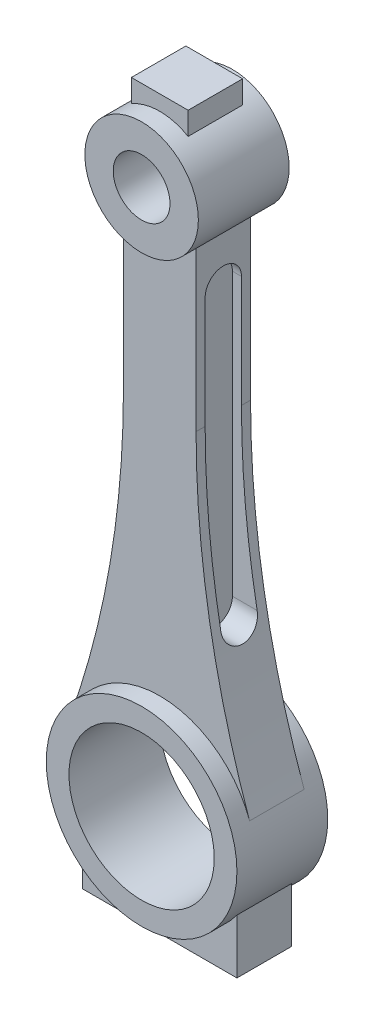
ISO-10303-21;
HEADER;
FILE_DESCRIPTION(('STEP AP214'),'2;1');
FILE_NAME('part.step','',(''),(''),'','','');
FILE_SCHEMA(('AUTOMOTIVE_DESIGN { 1 0 10303 214 1 1 1 1 }'));
ENDSEC;
DATA;
#1=APPLICATION_CONTEXT('core data for automotive mechanical design processes');
#2=APPLICATION_PROTOCOL_DEFINITION('international standard','automotive_design',2000,#1);
#3=PRODUCT_CONTEXT('',#1,'mechanical');
#4=PRODUCT('Part','Part','',(#3));
#5=PRODUCT_RELATED_PRODUCT_CATEGORY('part','',(#4));
#6=PRODUCT_DEFINITION_FORMATION('','',#4);
#7=PRODUCT_DEFINITION_CONTEXT('part definition',#1,'design');
#8=PRODUCT_DEFINITION('design','',#6,#7);
#9=PRODUCT_DEFINITION_SHAPE('','',#8);
#10=(LENGTH_UNIT() NAMED_UNIT(*) SI_UNIT(.MILLI.,.METRE.));
#11=(NAMED_UNIT(*) PLANE_ANGLE_UNIT() SI_UNIT($,.RADIAN.));
#12=(NAMED_UNIT(*) SI_UNIT($,.STERADIAN.) SOLID_ANGLE_UNIT());
#13=UNCERTAINTY_MEASURE_WITH_UNIT(LENGTH_MEASURE(1.E-05),#10,'distance_accuracy_value','');
#14=(GEOMETRIC_REPRESENTATION_CONTEXT(3) GLOBAL_UNCERTAINTY_ASSIGNED_CONTEXT((#13)) GLOBAL_UNIT_ASSIGNED_CONTEXT((#10,
#11,#12)) REPRESENTATION_CONTEXT('',''));
#15=CARTESIAN_POINT('',(0.,0.,0.));
#16=DIRECTION('',(0.,0.,1.));
#17=DIRECTION('',(1.,0.,0.));
#18=AXIS2_PLACEMENT_3D('',#15,#16,#17);
#19=CARTESIAN_POINT('',(212.132819979024,75.3953136438508,6.));
#20=DIRECTION('',(0.,0.,-1.));
#21=DIRECTION('',(-1.,0.,0.));
#22=AXIS2_PLACEMENT_3D('',#19,#20,#21);
#23=CYLINDRICAL_SURFACE('',#22,204.132819979024);
#24=CARTESIAN_POINT('',(11.4544735884215,38.,-4.00000000000001));
#25=CARTESIAN_POINT('',(11.4757515518411,37.8858086335559,-4.00000967356236));
#26=CARTESIAN_POINT('',(11.4971278489319,37.7716411229782,-3.9951101211208));
#27=CARTESIAN_POINT('',(11.5399210356049,37.5441527728839,-3.97557755361704));
#28=CARTESIAN_POINT('',(11.5613379239584,37.4308319082382,-3.9609448286138));
#29=CARTESIAN_POINT('',(11.6040518019029,37.2058589467753,-3.92203609087538));
#30=CARTESIAN_POINT('',(11.6253488219802,37.0942064124742,-3.89776265395078));
#31=CARTESIAN_POINT('',(11.6676599337569,36.8733657612217,-3.83975872762631));
#32=CARTESIAN_POINT('',(11.6886740293759,36.7641776101131,-3.80602836938937));
#33=CARTESIAN_POINT('',(11.7510730473326,36.4413470108117,-3.69089420326938));
#34=CARTESIAN_POINT('',(11.7918289081029,36.2323636826891,-3.59553432969807));
#35=CARTESIAN_POINT('',(11.8702126062763,35.833491871712,-3.37027556179513));
#36=CARTESIAN_POINT('',(11.9078413597511,35.643597793309,-3.24038682968163));
#37=CARTESIAN_POINT('',(11.9784728244352,35.2894796680367,-2.950436910244));
#38=CARTESIAN_POINT('',(12.0115036519544,35.1250988255321,-2.79057453802655));
#39=CARTESIAN_POINT('',(12.0720036427705,34.8256035029566,-2.44449926104124));
#40=CARTESIAN_POINT('',(12.0994724370193,34.6904909648341,-2.25828460915734));
#41=CARTESIAN_POINT('',(12.1473413477104,34.4559602912754,-1.86832249559897));
#42=CARTESIAN_POINT('',(12.1678582991115,34.3559510460777,-1.66494499104501));
#43=CARTESIAN_POINT('',(12.201667760202,34.1915558050773,-1.24372237948288));
#44=CARTESIAN_POINT('',(12.2149615713728,34.1271633917176,-1.02587988675161));
#45=CARTESIAN_POINT('',(12.2336033492388,34.0369591960168,-0.58627481212271));
#46=CARTESIAN_POINT('',(12.2390950212482,34.0104496060439,-0.364661335561859));
#47=CARTESIAN_POINT('',(12.2423732155318,33.9946184843632,0.0799443502249387));
#48=CARTESIAN_POINT('',(12.2401601145853,34.0052951341723,0.302936491499032));
#49=CARTESIAN_POINT('',(12.2281765408432,34.0632127244266,0.741781925824313));
#50=CARTESIAN_POINT('',(12.2184766498272,34.1101121767816,0.957682365575701));
#51=CARTESIAN_POINT('',(12.1919895794175,34.2385791029979,1.37844153266758));
#52=CARTESIAN_POINT('',(12.1752023313576,34.3201469127454,1.58330015300714));
#53=CARTESIAN_POINT('',(12.1350793834177,34.5159552856904,1.977397761575));
#54=CARTESIAN_POINT('',(12.1117098081663,34.6303649264094,2.16654921549123));
#55=CARTESIAN_POINT('',(12.0593260749272,34.8882465100265,2.52297125984127));
#56=CARTESIAN_POINT('',(12.0303117725959,35.0317191961119,2.69024129055298));
#57=CARTESIAN_POINT('',(11.9671383735568,35.3461665633751,3.00114206510914));
#58=CARTESIAN_POINT('',(11.9329025496515,35.5175545383741,3.14433904981939));
#59=CARTESIAN_POINT('',(11.8607975408037,35.8812712267655,3.40006280722765));
#60=CARTESIAN_POINT('',(11.8229268395297,36.0736086840292,3.51257670427656));
#61=CARTESIAN_POINT('',(11.744011046999,36.4777513253325,3.70593438635491));
#62=CARTESIAN_POINT('',(11.7029182624971,36.6898643551292,3.78611370956408));
#63=CARTESIAN_POINT('',(11.619535719839,37.1241795414682,3.90944320644274));
#64=CARTESIAN_POINT('',(11.5772477716993,37.3463667203578,3.95264656840455));
#65=CARTESIAN_POINT('',(11.5215540274852,37.6417241762258,3.98457340087694));
#66=CARTESIAN_POINT('',(11.5080944382148,37.713314753212,3.99036111817268));
#67=CARTESIAN_POINT('',(11.4812368188341,37.8565916807734,3.99806924003837));
#68=CARTESIAN_POINT('',(11.4678387235409,37.9282776734255,3.99999606757804));
#69=CARTESIAN_POINT('',(11.4544735884215,38.,3.99999999999999));
#70=B_SPLINE_CURVE_WITH_KNOTS('',3,(#24,#25,#26,#27,#28,#29,#30,#31,#32,#33,#34,#35,#36,#37,#38,
#39,#40,#41,#42,#43,#44,#45,#46,#47,#48,#49,#50,#51,#52,#53,#54,#55,#56,#57,#58,#59,#60,#61,#62,
#63,#64,#65,#66,#67,#68,#69),.UNSPECIFIED.,.F.,.F.,(4,2,2,2,2,2,2,2,2,2,2,2,2,2,2,2,2,2,2,2,2,2,
4),(0.,0.348357600629775,0.696704820295756,1.04495903090801,1.39320841164154,2.0894785742732,
2.78554404346984,3.47714614167071,4.16879411353829,4.84816302804554,5.52740949173435,
6.19397531687088,6.86050854603355,7.52083364695974,8.18116514562693,8.84495910470897,
9.50877004017901,10.1834922182609,10.8584970981523,11.546741507572,12.2339942357505,
12.4531452672714,12.6719314158043),.UNSPECIFIED.);
#71=CARTESIAN_POINT('',(11.4544735884215,38.,-4.00000000000001));
#72=VERTEX_POINT('',#71);
#73=CARTESIAN_POINT('',(11.4544735884215,38.,3.99999999999999));
#74=VERTEX_POINT('',#73);
#75=EDGE_CURVE('E401',#72,#74,#70,.T.);
#76=ORIENTED_EDGE('',*,*,#75,.T.);
#77=CARTESIAN_POINT('',(212.132819979024,75.3953136438508,4.));
#78=DIRECTION('',(0.,0.,-1.));
#79=DIRECTION('',(0.,1.,0.));
#80=AXIS2_PLACEMENT_3D('',#77,#78,#79);
#81=CIRCLE('',#80,204.132819979024);
#82=CARTESIAN_POINT('',(8.00000000000001,75.3953136438507,4.));
#83=VERTEX_POINT('',#82);
#84=EDGE_CURVE('E253',#74,#83,#81,.T.);
#85=ORIENTED_EDGE('',*,*,#84,.T.);
#86=DIRECTION('',(0.,0.,-1.));
#87=VECTOR('',#86,1.);
#88=CARTESIAN_POINT('',(8.00000000000001,75.3953136438507,6.));
#89=LINE('',#88,#87);
#90=CARTESIAN_POINT('',(8.00000000000001,75.3953136438507,6.));
#91=VERTEX_POINT('',#90);
#92=EDGE_CURVE('E368',#91,#83,#89,.T.);
#93=ORIENTED_EDGE('',*,*,#92,.F.);
#94=CARTESIAN_POINT('',(212.132819979024,75.3953136438508,6.));
#95=DIRECTION('',(0.,0.,1.));
#96=DIRECTION('',(1.,0.,0.));
#97=AXIS2_PLACEMENT_3D('',#94,#95,#96);
#98=CIRCLE('',#97,204.132819979024);
#99=CARTESIAN_POINT('',(19.7873824881444,7.03274443356763,6.));
#100=VERTEX_POINT('',#99);
#101=EDGE_CURVE('E343',#91,#100,#98,.T.);
#102=ORIENTED_EDGE('',*,*,#101,.T.);
#103=DIRECTION('',(0.,0.,-1.));
#104=VECTOR('',#103,1.);
#105=CARTESIAN_POINT('',(19.7873824881444,7.03274443356765,6.));
#106=LINE('',#105,#104);
#107=CARTESIAN_POINT('',(19.7873824881444,7.03274443356763,-6.));
#108=VERTEX_POINT('',#107);
#109=EDGE_CURVE('E371',#100,#108,#106,.T.);
#110=ORIENTED_EDGE('',*,*,#109,.T.);
#111=CARTESIAN_POINT('',(212.132819979024,75.3953136438508,-6.));
#112=DIRECTION('',(0.,0.,1.));
#113=DIRECTION('',(1.,0.,0.));
#114=AXIS2_PLACEMENT_3D('',#111,#112,#113);
#115=CIRCLE('',#114,204.132819979024);
#116=CARTESIAN_POINT('',(8.00000000000001,75.3953136438507,-6.));
#117=VERTEX_POINT('',#116);
#118=EDGE_CURVE('E361',#117,#108,#115,.T.);
#119=ORIENTED_EDGE('',*,*,#118,.F.);
#120=CARTESIAN_POINT('',(8.00000000000001,75.3953136438507,-4.));
#121=VERTEX_POINT('',#120);
#122=EDGE_CURVE('E367',#121,#117,#89,.T.);
#123=ORIENTED_EDGE('',*,*,#122,.F.);
#124=CARTESIAN_POINT('',(212.132819979024,75.3953136438508,-4.00000000000001));
#125=DIRECTION('',(0.,0.,1.));
#126=DIRECTION('',(0.,-1.,0.));
#127=AXIS2_PLACEMENT_3D('',#124,#125,#126);
#128=CIRCLE('',#127,204.132819979024);
#129=EDGE_CURVE('E59',#121,#72,#128,.T.);
#130=ORIENTED_EDGE('',*,*,#129,.T.);
#131=EDGE_LOOP('',(#76,#85,#93,#102,#110,#119,#123,#130));
#132=FACE_BOUND('',#131,.T.);
#133=ADVANCED_FACE('F36',(#132),#23,.F.);
#134=CARTESIAN_POINT('',(8.00000000000004,0.,6.));
#135=DIRECTION('',(-1.,0.,0.));
#136=DIRECTION('',(0.,-1.,0.));
#137=AXIS2_PLACEMENT_3D('',#134,#135,#136);
#138=PLANE('',#137);
#139=DIRECTION('',(0.,-1.,0.));
#140=VECTOR('',#139,1.);
#141=CARTESIAN_POINT('',(8.00000000000004,0.,3.99999999999999));
#142=LINE('',#141,#140);
#143=CARTESIAN_POINT('',(8.00000000000001,100.,4.));
#144=VERTEX_POINT('',#143);
#145=EDGE_CURVE('E399',#144,#83,#142,.T.);
#146=ORIENTED_EDGE('',*,*,#145,.F.);
#147=CARTESIAN_POINT('',(8.,100.,0.));
#148=DIRECTION('',(-1.,0.,0.));
#149=DIRECTION('',(0.,-1.,0.));
#150=AXIS2_PLACEMENT_3D('',#147,#148,#149);
#151=CIRCLE('',#150,4.);
#152=CARTESIAN_POINT('',(8.00000000000001,100.,-4.));
#153=VERTEX_POINT('',#152);
#154=EDGE_CURVE('E397',#153,#144,#151,.F.);
#155=ORIENTED_EDGE('',*,*,#154,.F.);
#156=DIRECTION('',(0.,1.,0.));
#157=VECTOR('',#156,1.);
#158=CARTESIAN_POINT('',(8.00000000000004,0.,-4.00000000000002));
#159=LINE('',#158,#157);
#160=EDGE_CURVE('E391',#121,#153,#159,.T.);
#161=ORIENTED_EDGE('',*,*,#160,.F.);
#162=ORIENTED_EDGE('',*,*,#122,.T.);
#163=DIRECTION('',(0.,1.,0.));
#164=VECTOR('',#163,1.);
#165=CARTESIAN_POINT('',(8.00000000000004,0.,-6.));
#166=LINE('',#165,#164);
#167=CARTESIAN_POINT('',(8.,110.395313643851,-6.));
#168=VERTEX_POINT('',#167);
#169=EDGE_CURVE('E335',#117,#168,#166,.T.);
#170=ORIENTED_EDGE('',*,*,#169,.T.);
#171=DIRECTION('',(0.,0.,-1.));
#172=VECTOR('',#171,1.);
#173=CARTESIAN_POINT('',(8.,110.395313643851,6.));
#174=LINE('',#173,#172);
#175=CARTESIAN_POINT('',(8.,110.395313643851,6.));
#176=VERTEX_POINT('',#175);
#177=EDGE_CURVE('E349',#176,#168,#174,.T.);
#178=ORIENTED_EDGE('',*,*,#177,.F.);
#179=DIRECTION('',(0.,1.,0.));
#180=VECTOR('',#179,1.);
#181=CARTESIAN_POINT('',(8.00000000000004,0.,6.));
#182=LINE('',#181,#180);
#183=EDGE_CURVE('E346',#91,#176,#182,.T.);
#184=ORIENTED_EDGE('',*,*,#183,.F.);
#185=ORIENTED_EDGE('',*,*,#92,.T.);
#186=EDGE_LOOP('',(#146,#155,#161,#162,#170,#178,#184,#185));
#187=FACE_BOUND('',#186,.T.);
#188=ADVANCED_FACE('F495',(#187),#138,.F.);
#189=CARTESIAN_POINT('',(0.,120.,10.));
#190=DIRECTION('',(0.,0.,-1.));
#191=DIRECTION('',(-1.,0.,0.));
#192=AXIS2_PLACEMENT_3D('',#189,#190,#191);
#193=CYLINDRICAL_SURFACE('',#192,6.25);
#194=CARTESIAN_POINT('',(0.,120.,10.));
#195=DIRECTION('',(0.,0.,1.));
#196=DIRECTION('',(1.,0.,0.));
#197=AXIS2_PLACEMENT_3D('',#194,#195,#196);
#198=CIRCLE('',#197,6.25);
#199=CARTESIAN_POINT('',(6.25000000000001,120.,10.));
#200=VERTEX_POINT('',#199);
#201=EDGE_CURVE('E384',#200,#200,#198,.T.);
#202=ORIENTED_EDGE('',*,*,#201,.T.);
#203=EDGE_LOOP('',(#202));
#204=FACE_BOUND('',#203,.T.);
#205=CARTESIAN_POINT('',(0.,120.,-10.));
#206=DIRECTION('',(0.,0.,1.));
#207=DIRECTION('',(1.,0.,0.));
#208=AXIS2_PLACEMENT_3D('',#205,#206,#207);
#209=CIRCLE('',#208,6.25);
#210=CARTESIAN_POINT('',(6.25000000000001,120.,-10.));
#211=VERTEX_POINT('',#210);
#212=EDGE_CURVE('E383',#211,#211,#209,.T.);
#213=ORIENTED_EDGE('',*,*,#212,.F.);
#214=EDGE_LOOP('',(#213));
#215=FACE_BOUND('',#214,.T.);
#216=ADVANCED_FACE('F38',(#204,#215),#193,.F.);
#217=CARTESIAN_POINT('',(0.,120.,10.));
#218=DIRECTION('',(0.,0.,-1.));
#219=DIRECTION('',(-1.,0.,0.));
#220=AXIS2_PLACEMENT_3D('',#217,#218,#219);
#221=CYLINDRICAL_SURFACE('',#220,12.5);
#222=DIRECTION('',(0.,0.,-1.));
#223=VECTOR('',#222,1.);
#224=CARTESIAN_POINT('',(6.25,130.825317547305,6.));
#225=LINE('',#224,#223);
#226=CARTESIAN_POINT('',(6.25,130.825317547305,6.));
#227=VERTEX_POINT('',#226);
#228=CARTESIAN_POINT('',(6.25000000000001,130.825317547305,-6.));
#229=VERTEX_POINT('',#228);
#230=EDGE_CURVE('E284',#227,#229,#225,.T.);
#231=ORIENTED_EDGE('',*,*,#230,.F.);
#232=CARTESIAN_POINT('',(0.,120.,6.));
#233=DIRECTION('',(0.,0.,1.));
#234=DIRECTION('',(1.,0.,0.));
#235=AXIS2_PLACEMENT_3D('',#232,#233,#234);
#236=CIRCLE('',#235,12.5);
#237=CARTESIAN_POINT('',(-6.25,130.825317547305,6.));
#238=VERTEX_POINT('',#237);
#239=EDGE_CURVE('E257',#227,#238,#236,.T.);
#240=ORIENTED_EDGE('',*,*,#239,.T.);
#241=DIRECTION('',(0.,0.,-1.));
#242=VECTOR('',#241,1.);
#243=CARTESIAN_POINT('',(-6.25,130.825317547305,6.));
#244=LINE('',#243,#242);
#245=CARTESIAN_POINT('',(-6.25,130.825317547305,-6.));
#246=VERTEX_POINT('',#245);
#247=EDGE_CURVE('E268',#238,#246,#244,.T.);
#248=ORIENTED_EDGE('',*,*,#247,.T.);
#249=CARTESIAN_POINT('',(0.,120.,-6.));
#250=DIRECTION('',(0.,0.,1.));
#251=DIRECTION('',(1.,0.,0.));
#252=AXIS2_PLACEMENT_3D('',#249,#250,#251);
#253=CIRCLE('',#252,12.5);
#254=EDGE_CURVE('E256',#229,#246,#253,.T.);
#255=ORIENTED_EDGE('',*,*,#254,.F.);
#256=EDGE_LOOP('',(#231,#240,#248,#255));
#257=FACE_BOUND('',#256,.T.);
#258=DIRECTION('',(0.,0.,-1.));
#259=VECTOR('',#258,1.);
#260=CARTESIAN_POINT('',(-7.99999999999999,110.395313643851,6.));
#261=LINE('',#260,#259);
#262=CARTESIAN_POINT('',(-7.99999999999999,110.395313643851,6.));
#263=VERTEX_POINT('',#262);
#264=CARTESIAN_POINT('',(-7.99999999999999,110.395313643851,-6.));
#265=VERTEX_POINT('',#264);
#266=EDGE_CURVE('E380',#263,#265,#261,.T.);
#267=ORIENTED_EDGE('',*,*,#266,.F.);
#268=CARTESIAN_POINT('',(0.,120.,6.));
#269=DIRECTION('',(0.,0.,1.));
#270=DIRECTION('',(1.,0.,0.));
#271=AXIS2_PLACEMENT_3D('',#268,#269,#270);
#272=CIRCLE('',#271,12.5);
#273=EDGE_CURVE('E332',#263,#176,#272,.T.);
#274=ORIENTED_EDGE('',*,*,#273,.T.);
#275=ORIENTED_EDGE('',*,*,#177,.T.);
#276=CARTESIAN_POINT('',(0.,120.,-6.));
#277=DIRECTION('',(0.,0.,1.));
#278=DIRECTION('',(1.,0.,0.));
#279=AXIS2_PLACEMENT_3D('',#276,#277,#278);
#280=CIRCLE('',#279,12.5);
#281=EDGE_CURVE('E327',#265,#168,#280,.T.);
#282=ORIENTED_EDGE('',*,*,#281,.F.);
#283=EDGE_LOOP('',(#267,#274,#275,#282));
#284=FACE_BOUND('',#283,.T.);
#285=CARTESIAN_POINT('',(0.,120.,10.));
#286=DIRECTION('',(0.,0.,1.));
#287=DIRECTION('',(1.,0.,0.));
#288=AXIS2_PLACEMENT_3D('',#285,#286,#287);
#289=CIRCLE('',#288,12.5);
#290=CARTESIAN_POINT('',(12.5,120.,10.));
#291=VERTEX_POINT('',#290);
#292=EDGE_CURVE('E387',#291,#291,#289,.T.);
#293=ORIENTED_EDGE('',*,*,#292,.F.);
#294=EDGE_LOOP('',(#293));
#295=FACE_BOUND('',#294,.T.);
#296=CARTESIAN_POINT('',(0.,120.,-10.));
#297=DIRECTION('',(0.,0.,1.));
#298=DIRECTION('',(1.,0.,0.));
#299=AXIS2_PLACEMENT_3D('',#296,#297,#298);
#300=CIRCLE('',#299,12.5);
#301=CARTESIAN_POINT('',(12.5,120.,-10.));
#302=VERTEX_POINT('',#301);
#303=EDGE_CURVE('E388',#302,#302,#300,.T.);
#304=ORIENTED_EDGE('',*,*,#303,.T.);
#305=EDGE_LOOP('',(#304));
#306=FACE_BOUND('',#305,.T.);
#307=ADVANCED_FACE('F502',(#257,#284,#295,#306),#221,.T.);
#308=CARTESIAN_POINT('',(0.,0.,10.));
#309=DIRECTION('',(0.,0.,1.));
#310=DIRECTION('',(1.,0.,0.));
#311=AXIS2_PLACEMENT_3D('',#308,#309,#310);
#312=PLANE('',#311);
#313=ORIENTED_EDGE('',*,*,#201,.F.);
#314=EDGE_LOOP('',(#313));
#315=FACE_BOUND('',#314,.T.);
#316=ORIENTED_EDGE('',*,*,#292,.T.);
#317=EDGE_LOOP('',(#316));
#318=FACE_BOUND('',#317,.T.);
#319=ADVANCED_FACE('F549',(#315,#318),#312,.T.);
#320=CARTESIAN_POINT('',(0.,0.,-10.));
#321=DIRECTION('',(0.,0.,1.));
#322=DIRECTION('',(1.,0.,0.));
#323=AXIS2_PLACEMENT_3D('',#320,#321,#322);
#324=PLANE('',#323);
#325=ORIENTED_EDGE('',*,*,#212,.T.);
#326=EDGE_LOOP('',(#325));
#327=FACE_BOUND('',#326,.T.);
#328=ORIENTED_EDGE('',*,*,#303,.F.);
#329=EDGE_LOOP('',(#328));
#330=FACE_BOUND('',#329,.T.);
#331=ADVANCED_FACE('F547',(#327,#330),#324,.F.);
#332=CARTESIAN_POINT('',(-7.99999999999999,0.,6.));
#333=DIRECTION('',(-1.,0.,0.));
#334=DIRECTION('',(0.,-1.,0.));
#335=AXIS2_PLACEMENT_3D('',#332,#333,#334);
#336=PLANE('',#335);
#337=DIRECTION('',(0.,-1.,0.));
#338=VECTOR('',#337,1.);
#339=CARTESIAN_POINT('',(-7.99999999999999,0.,-4.00000000000002));
#340=LINE('',#339,#338);
#341=CARTESIAN_POINT('',(-7.99999999999999,100.,-4.));
#342=VERTEX_POINT('',#341);
#343=CARTESIAN_POINT('',(-7.99999999999998,75.3953136438507,-4.00000000000001));
#344=VERTEX_POINT('',#343);
#345=EDGE_CURVE('E230',#342,#344,#340,.T.);
#346=ORIENTED_EDGE('',*,*,#345,.F.);
#347=CARTESIAN_POINT('',(-7.99999999999999,100.,0.));
#348=DIRECTION('',(-1.,0.,0.));
#349=DIRECTION('',(0.,-1.,0.));
#350=AXIS2_PLACEMENT_3D('',#347,#348,#349);
#351=CIRCLE('',#350,4.);
#352=CARTESIAN_POINT('',(-7.99999999999999,100.,4.));
#353=VERTEX_POINT('',#352);
#354=EDGE_CURVE('E11',#353,#342,#351,.T.);
#355=ORIENTED_EDGE('',*,*,#354,.F.);
#356=DIRECTION('',(0.,1.,0.));
#357=VECTOR('',#356,1.);
#358=CARTESIAN_POINT('',(-7.99999999999999,0.,3.99999999999999));
#359=LINE('',#358,#357);
#360=CARTESIAN_POINT('',(-7.99999999999998,75.3953136438507,4.));
#361=VERTEX_POINT('',#360);
#362=EDGE_CURVE('E207',#361,#353,#359,.T.);
#363=ORIENTED_EDGE('',*,*,#362,.F.);
#364=DIRECTION('',(0.,0.,-1.));
#365=VECTOR('',#364,1.);
#366=CARTESIAN_POINT('',(-7.99999999999999,75.3953136438507,6.));
#367=LINE('',#366,#365);
#368=CARTESIAN_POINT('',(-7.99999999999999,75.3953136438507,6.));
#369=VERTEX_POINT('',#368);
#370=EDGE_CURVE('E377',#369,#361,#367,.T.);
#371=ORIENTED_EDGE('',*,*,#370,.F.);
#372=DIRECTION('',(0.,1.,0.));
#373=VECTOR('',#372,1.);
#374=CARTESIAN_POINT('',(-7.99999999999999,0.,6.));
#375=LINE('',#374,#373);
#376=EDGE_CURVE('E334',#369,#263,#375,.T.);
#377=ORIENTED_EDGE('',*,*,#376,.T.);
#378=ORIENTED_EDGE('',*,*,#266,.T.);
#379=DIRECTION('',(0.,1.,0.));
#380=VECTOR('',#379,1.);
#381=CARTESIAN_POINT('',(-7.99999999999999,0.,-6.));
#382=LINE('',#381,#380);
#383=CARTESIAN_POINT('',(-7.99999999999999,75.3953136438507,-6.));
#384=VERTEX_POINT('',#383);
#385=EDGE_CURVE('E352',#384,#265,#382,.T.);
#386=ORIENTED_EDGE('',*,*,#385,.F.);
#387=EDGE_CURVE('E376',#344,#384,#367,.T.);
#388=ORIENTED_EDGE('',*,*,#387,.F.);
#389=EDGE_LOOP('',(#346,#355,#363,#371,#377,#378,#386,#388));
#390=FACE_BOUND('',#389,.T.);
#391=ADVANCED_FACE('F543',(#390),#336,.T.);
#392=CARTESIAN_POINT('',(-212.132819979024,75.3953136438507,6.));
#393=DIRECTION('',(0.,0.,-1.));
#394=DIRECTION('',(-1.,0.,0.));
#395=AXIS2_PLACEMENT_3D('',#392,#393,#394);
#396=CYLINDRICAL_SURFACE('',#395,204.132819979024);
#397=CARTESIAN_POINT('',(-11.4544735884215,38.,3.99999999999999));
#398=CARTESIAN_POINT('',(-11.4757515518411,37.8858086335559,4.00000967356234));
#399=CARTESIAN_POINT('',(-11.4971278489319,37.7716411229782,3.99511012112078));
#400=CARTESIAN_POINT('',(-11.5399210356049,37.5441527728839,3.97557755361703));
#401=CARTESIAN_POINT('',(-11.5613379239584,37.4308319082382,3.96094482861378));
#402=CARTESIAN_POINT('',(-11.6040518019029,37.2058589467753,3.92203609087537));
#403=CARTESIAN_POINT('',(-11.6253488219802,37.0942064124742,3.89776265395076));
#404=CARTESIAN_POINT('',(-11.6676599337568,36.8733657612217,3.83975872762629));
#405=CARTESIAN_POINT('',(-11.6886740293759,36.7641776101131,3.80602836938935));
#406=CARTESIAN_POINT('',(-11.7510730473326,36.4413470108117,3.69089420326937));
#407=CARTESIAN_POINT('',(-11.7918289081029,36.2323636826891,3.59553432969806));
#408=CARTESIAN_POINT('',(-11.8702126062763,35.833491871712,3.37027556179512));
#409=CARTESIAN_POINT('',(-11.9078413597511,35.643597793309,3.24038682968162));
#410=CARTESIAN_POINT('',(-11.9784728244352,35.2894796680367,2.95043691024399));
#411=CARTESIAN_POINT('',(-12.0115036519544,35.1250988255321,2.79057453802654));
#412=CARTESIAN_POINT('',(-12.0720036427705,34.8256035029566,2.44449926104123));
#413=CARTESIAN_POINT('',(-12.0994724370193,34.6904909648341,2.25828460915733));
#414=CARTESIAN_POINT('',(-12.1473413477104,34.4559602912754,1.86832249559896));
#415=CARTESIAN_POINT('',(-12.1678582991115,34.3559510460777,1.664944991045));
#416=CARTESIAN_POINT('',(-12.201667760202,34.1915558050773,1.24372237948287));
#417=CARTESIAN_POINT('',(-12.2149615713728,34.1271633917176,1.0258798867516));
#418=CARTESIAN_POINT('',(-12.2336033492387,34.0369591960168,0.586274812122693));
#419=CARTESIAN_POINT('',(-12.2390950212481,34.0104496060439,0.364661335561844));
#420=CARTESIAN_POINT('',(-12.2423732155318,33.9946184843632,-0.079944350224952));
#421=CARTESIAN_POINT('',(-12.2401601145853,34.0052951341723,-0.302936491499045));
#422=CARTESIAN_POINT('',(-12.2281765408432,34.0632127244266,-0.741781925824323));
#423=CARTESIAN_POINT('',(-12.2184766498272,34.1101121767816,-0.957682365575708));
#424=CARTESIAN_POINT('',(-12.1919895794175,34.2385791029979,-1.37844153266759));
#425=CARTESIAN_POINT('',(-12.1752023313576,34.3201469127454,-1.58330015300715));
#426=CARTESIAN_POINT('',(-12.1350793834177,34.5159552856904,-1.97739776157501));
#427=CARTESIAN_POINT('',(-12.1117098081663,34.6303649264094,-2.16654921549124));
#428=CARTESIAN_POINT('',(-12.0593260749272,34.8882465100265,-2.52297125984128));
#429=CARTESIAN_POINT('',(-12.0303117725959,35.0317191961119,-2.690241290553));
#430=CARTESIAN_POINT('',(-11.9671383735568,35.3461665633751,-3.00114206510915));
#431=CARTESIAN_POINT('',(-11.9329025496515,35.5175545383741,-3.1443390498194));
#432=CARTESIAN_POINT('',(-11.8607975408037,35.8812712267655,-3.40006280722766));
#433=CARTESIAN_POINT('',(-11.8229268395297,36.0736086840292,-3.51257670427657));
#434=CARTESIAN_POINT('',(-11.744011046999,36.4777513253325,-3.70593438635493));
#435=CARTESIAN_POINT('',(-11.7029182624971,36.6898643551292,-3.7861137095641));
#436=CARTESIAN_POINT('',(-11.6195357198389,37.1241795414682,-3.90944320644276));
#437=CARTESIAN_POINT('',(-11.5772477716993,37.3463667203578,-3.95264656840456));
#438=CARTESIAN_POINT('',(-11.5215540274852,37.6417241762258,-3.98457340087696));
#439=CARTESIAN_POINT('',(-11.5080944382148,37.713314753212,-3.9903611181727));
#440=CARTESIAN_POINT('',(-11.4812368188341,37.8565916807734,-3.99806924003838));
#441=CARTESIAN_POINT('',(-11.4678387235409,37.9282776734255,-3.99999606757806));
#442=CARTESIAN_POINT('',(-11.4544735884215,38.,-4.00000000000001));
#443=B_SPLINE_CURVE_WITH_KNOTS('',3,(#397,#398,#399,#400,#401,#402,#403,#404,#405,#406,#407,
#408,#409,#410,#411,#412,#413,#414,#415,#416,#417,#418,#419,#420,#421,#422,#423,#424,#425,#426,
#427,#428,#429,#430,#431,#432,#433,#434,#435,#436,#437,#438,#439,#440,#441,#442),.UNSPECIFIED.,
.F.,.F.,(4,2,2,2,2,2,2,2,2,2,2,2,2,2,2,2,2,2,2,2,2,2,4),(0.,0.348357600629777,0.69670482029575,
1.044959030908,1.39320841164154,2.0894785742732,2.78554404346982,3.47714614167071,
4.16879411353828,4.84816302804554,5.52740949173435,6.19397531687088,6.86050854603354,
7.52083364695973,8.18116514562692,8.84495910470896,9.50877004017899,10.1834922182609,
10.8584970981523,11.546741507572,12.2339942357505,12.4531452672714,12.6719314158043),.UNSPECIFIED.);
#444=CARTESIAN_POINT('',(-11.4544735884215,38.,3.99999999999999));
#445=VERTEX_POINT('',#444);
#446=CARTESIAN_POINT('',(-11.4544735884215,38.,-4.00000000000001));
#447=VERTEX_POINT('',#446);
#448=EDGE_CURVE('E534',#445,#447,#443,.T.);
#449=ORIENTED_EDGE('',*,*,#448,.T.);
#450=CARTESIAN_POINT('',(-212.132819979024,75.3953136438507,-4.00000000000001));
#451=DIRECTION('',(0.,0.,-1.));
#452=DIRECTION('',(0.,1.,0.));
#453=AXIS2_PLACEMENT_3D('',#450,#451,#452);
#454=CIRCLE('',#453,204.132819979024);
#455=EDGE_CURVE('E44',#447,#344,#454,.F.);
#456=ORIENTED_EDGE('',*,*,#455,.T.);
#457=ORIENTED_EDGE('',*,*,#387,.T.);
#458=CARTESIAN_POINT('',(-212.132819979024,75.3953136438507,-6.));
#459=DIRECTION('',(0.,0.,1.));
#460=DIRECTION('',(1.,0.,0.));
#461=AXIS2_PLACEMENT_3D('',#458,#459,#460);
#462=CIRCLE('',#461,204.132819979024);
#463=CARTESIAN_POINT('',(-19.7873824881444,7.03274443356764,-6.));
#464=VERTEX_POINT('',#463);
#465=EDGE_CURVE('E355',#384,#464,#462,.F.);
#466=ORIENTED_EDGE('',*,*,#465,.T.);
#467=DIRECTION('',(0.,0.,-1.));
#468=VECTOR('',#467,1.);
#469=CARTESIAN_POINT('',(-19.7873824881444,7.03274443356764,6.));
#470=LINE('',#469,#468);
#471=CARTESIAN_POINT('',(-19.7873824881444,7.03274443356764,6.));
#472=VERTEX_POINT('',#471);
#473=EDGE_CURVE('E374',#472,#464,#470,.T.);
#474=ORIENTED_EDGE('',*,*,#473,.F.);
#475=CARTESIAN_POINT('',(-212.132819979024,75.3953136438507,6.));
#476=DIRECTION('',(0.,0.,1.));
#477=DIRECTION('',(1.,0.,0.));
#478=AXIS2_PLACEMENT_3D('',#475,#476,#477);
#479=CIRCLE('',#478,204.132819979024);
#480=EDGE_CURVE('E338',#369,#472,#479,.F.);
#481=ORIENTED_EDGE('',*,*,#480,.F.);
#482=ORIENTED_EDGE('',*,*,#370,.T.);
#483=CARTESIAN_POINT('',(-212.132819979024,75.3953136438507,4.));
#484=DIRECTION('',(0.,0.,1.));
#485=DIRECTION('',(0.,-1.,0.));
#486=AXIS2_PLACEMENT_3D('',#483,#484,#485);
#487=CIRCLE('',#486,204.132819979024);
#488=EDGE_CURVE('E410',#361,#445,#487,.F.);
#489=ORIENTED_EDGE('',*,*,#488,.T.);
#490=EDGE_LOOP('',(#449,#456,#457,#466,#474,#481,#482,#489));
#491=FACE_BOUND('',#490,.T.);
#492=ADVANCED_FACE('F491',(#491),#396,.F.);
#493=CARTESIAN_POINT('',(0.,0.,6.));
#494=DIRECTION('',(0.,0.,1.));
#495=DIRECTION('',(1.,0.,0.));
#496=AXIS2_PLACEMENT_3D('',#493,#494,#495);
#497=PLANE('',#496);
#498=ORIENTED_EDGE('',*,*,#273,.F.);
#499=ORIENTED_EDGE('',*,*,#376,.F.);
#500=ORIENTED_EDGE('',*,*,#480,.T.);
#501=CARTESIAN_POINT('',(0.,0.,6.));
#502=DIRECTION('',(0.,0.,1.));
#503=DIRECTION('',(1.,0.,0.));
#504=AXIS2_PLACEMENT_3D('',#501,#502,#503);
#505=CIRCLE('',#504,21.);
#506=EDGE_CURVE('E341',#100,#472,#505,.T.);
#507=ORIENTED_EDGE('',*,*,#506,.F.);
#508=ORIENTED_EDGE('',*,*,#101,.F.);
#509=ORIENTED_EDGE('',*,*,#183,.T.);
#510=EDGE_LOOP('',(#498,#499,#500,#507,#508,#509));
#511=FACE_BOUND('',#510,.T.);
#512=ADVANCED_FACE('F488',(#511),#497,.T.);
#513=CARTESIAN_POINT('',(0.,0.,-6.));
#514=DIRECTION('',(0.,0.,1.));
#515=DIRECTION('',(1.,0.,0.));
#516=AXIS2_PLACEMENT_3D('',#513,#514,#515);
#517=PLANE('',#516);
#518=ORIENTED_EDGE('',*,*,#281,.T.);
#519=ORIENTED_EDGE('',*,*,#169,.F.);
#520=ORIENTED_EDGE('',*,*,#118,.T.);
#521=CARTESIAN_POINT('',(0.,0.,-6.));
#522=DIRECTION('',(0.,0.,1.));
#523=DIRECTION('',(1.,0.,0.));
#524=AXIS2_PLACEMENT_3D('',#521,#522,#523);
#525=CIRCLE('',#524,21.);
#526=EDGE_CURVE('E358',#108,#464,#525,.T.);
#527=ORIENTED_EDGE('',*,*,#526,.T.);
#528=ORIENTED_EDGE('',*,*,#465,.F.);
#529=ORIENTED_EDGE('',*,*,#385,.T.);
#530=EDGE_LOOP('',(#518,#519,#520,#527,#528,#529));
#531=FACE_BOUND('',#530,.T.);
#532=ADVANCED_FACE('F486',(#531),#517,.F.);
#533=CARTESIAN_POINT('',(0.,0.,10.));
#534=DIRECTION('',(0.,0.,-1.));
#535=DIRECTION('',(-1.,0.,0.));
#536=AXIS2_PLACEMENT_3D('',#533,#534,#535);
#537=CYLINDRICAL_SURFACE('',#536,16.);
#538=CARTESIAN_POINT('',(0.,0.,10.));
#539=DIRECTION('',(0.,0.,1.));
#540=DIRECTION('',(1.,0.,0.));
#541=AXIS2_PLACEMENT_3D('',#538,#539,#540);
#542=CIRCLE('',#541,16.);
#543=CARTESIAN_POINT('',(16.,0.,10.));
#544=VERTEX_POINT('',#543);
#545=EDGE_CURVE('E320',#544,#544,#542,.T.);
#546=ORIENTED_EDGE('',*,*,#545,.T.);
#547=EDGE_LOOP('',(#546));
#548=FACE_BOUND('',#547,.T.);
#549=CARTESIAN_POINT('',(0.,0.,-10.));
#550=DIRECTION('',(0.,0.,1.));
#551=DIRECTION('',(1.,0.,0.));
#552=AXIS2_PLACEMENT_3D('',#549,#550,#551);
#553=CIRCLE('',#552,16.);
#554=CARTESIAN_POINT('',(16.,0.,-10.));
#555=VERTEX_POINT('',#554);
#556=EDGE_CURVE('E319',#555,#555,#553,.T.);
#557=ORIENTED_EDGE('',*,*,#556,.F.);
#558=EDGE_LOOP('',(#557));
#559=FACE_BOUND('',#558,.T.);
#560=ADVANCED_FACE('F482',(#548,#559),#537,.F.);
#561=CARTESIAN_POINT('',(0.,0.,10.));
#562=DIRECTION('',(0.,0.,-1.));
#563=DIRECTION('',(-1.,0.,0.));
#564=AXIS2_PLACEMENT_3D('',#561,#562,#563);
#565=CYLINDRICAL_SURFACE('',#564,21.);
#566=DIRECTION('',(0.,0.,-1.));
#567=VECTOR('',#566,1.);
#568=CARTESIAN_POINT('',(-17.,-12.328828005938,6.));
#569=LINE('',#568,#567);
#570=CARTESIAN_POINT('',(-17.,-12.328828005938,6.));
#571=VERTEX_POINT('',#570);
#572=CARTESIAN_POINT('',(-17.,-12.328828005938,-6.));
#573=VERTEX_POINT('',#572);
#574=EDGE_CURVE('E316',#571,#573,#569,.T.);
#575=ORIENTED_EDGE('',*,*,#574,.F.);
#576=CARTESIAN_POINT('',(0.,0.,6.));
#577=DIRECTION('',(0.,0.,1.));
#578=DIRECTION('',(1.,0.,0.));
#579=AXIS2_PLACEMENT_3D('',#576,#577,#578);
#580=CIRCLE('',#579,21.);
#581=CARTESIAN_POINT('',(17.,-12.3288280059379,6.));
#582=VERTEX_POINT('',#581);
#583=EDGE_CURVE('E288',#571,#582,#580,.T.);
#584=ORIENTED_EDGE('',*,*,#583,.T.);
#585=DIRECTION('',(0.,0.,-1.));
#586=VECTOR('',#585,1.);
#587=CARTESIAN_POINT('',(17.,-12.328828005938,6.));
#588=LINE('',#587,#586);
#589=CARTESIAN_POINT('',(17.,-12.328828005938,-6.));
#590=VERTEX_POINT('',#589);
#591=EDGE_CURVE('E300',#582,#590,#588,.T.);
#592=ORIENTED_EDGE('',*,*,#591,.T.);
#593=CARTESIAN_POINT('',(0.,0.,-6.));
#594=DIRECTION('',(0.,0.,1.));
#595=DIRECTION('',(1.,0.,0.));
#596=AXIS2_PLACEMENT_3D('',#593,#594,#595);
#597=CIRCLE('',#596,21.);
#598=EDGE_CURVE('E287',#573,#590,#597,.T.);
#599=ORIENTED_EDGE('',*,*,#598,.F.);
#600=EDGE_LOOP('',(#575,#584,#592,#599));
#601=FACE_BOUND('',#600,.T.);
#602=ORIENTED_EDGE('',*,*,#506,.T.);
#603=ORIENTED_EDGE('',*,*,#473,.T.);
#604=ORIENTED_EDGE('',*,*,#526,.F.);
#605=ORIENTED_EDGE('',*,*,#109,.F.);
#606=EDGE_LOOP('',(#602,#603,#604,#605));
#607=FACE_BOUND('',#606,.T.);
#608=CARTESIAN_POINT('',(0.,0.,10.));
#609=DIRECTION('',(0.,0.,1.));
#610=DIRECTION('',(1.,0.,0.));
#611=AXIS2_PLACEMENT_3D('',#608,#609,#610);
#612=CIRCLE('',#611,21.);
#613=CARTESIAN_POINT('',(21.,0.,10.));
#614=VERTEX_POINT('',#613);
#615=EDGE_CURVE('E323',#614,#614,#612,.T.);
#616=ORIENTED_EDGE('',*,*,#615,.F.);
#617=EDGE_LOOP('',(#616));
#618=FACE_BOUND('',#617,.T.);
#619=CARTESIAN_POINT('',(0.,0.,-10.));
#620=DIRECTION('',(0.,0.,1.));
#621=DIRECTION('',(1.,0.,0.));
#622=AXIS2_PLACEMENT_3D('',#619,#620,#621);
#623=CIRCLE('',#622,21.);
#624=CARTESIAN_POINT('',(21.,0.,-10.));
#625=VERTEX_POINT('',#624);
#626=EDGE_CURVE('E324',#625,#625,#623,.T.);
#627=ORIENTED_EDGE('',*,*,#626,.T.);
#628=EDGE_LOOP('',(#627));
#629=FACE_BOUND('',#628,.T.);
#630=ADVANCED_FACE('F475',(#601,#607,#618,#629),#565,.T.);
#631=CARTESIAN_POINT('',(0.,0.,10.));
#632=DIRECTION('',(0.,0.,1.));
#633=DIRECTION('',(1.,0.,0.));
#634=AXIS2_PLACEMENT_3D('',#631,#632,#633);
#635=PLANE('',#634);
#636=ORIENTED_EDGE('',*,*,#545,.F.);
#637=EDGE_LOOP('',(#636));
#638=FACE_BOUND('',#637,.T.);
#639=ORIENTED_EDGE('',*,*,#615,.T.);
#640=EDGE_LOOP('',(#639));
#641=FACE_BOUND('',#640,.T.);
#642=ADVANCED_FACE('F472',(#638,#641),#635,.T.);
#643=CARTESIAN_POINT('',(0.,0.,-10.));
#644=DIRECTION('',(0.,0.,1.));
#645=DIRECTION('',(1.,0.,0.));
#646=AXIS2_PLACEMENT_3D('',#643,#644,#645);
#647=PLANE('',#646);
#648=ORIENTED_EDGE('',*,*,#556,.T.);
#649=EDGE_LOOP('',(#648));
#650=FACE_BOUND('',#649,.T.);
#651=ORIENTED_EDGE('',*,*,#626,.F.);
#652=EDGE_LOOP('',(#651));
#653=FACE_BOUND('',#652,.T.);
#654=ADVANCED_FACE('F470',(#650,#653),#647,.F.);
#655=CARTESIAN_POINT('',(-17.,0.,6.));
#656=DIRECTION('',(-1.,0.,0.));
#657=DIRECTION('',(0.,-1.,0.));
#658=AXIS2_PLACEMENT_3D('',#655,#656,#657);
#659=PLANE('',#658);
#660=DIRECTION('',(0.,1.,0.));
#661=VECTOR('',#660,1.);
#662=CARTESIAN_POINT('',(-17.,0.,-6.));
#663=LINE('',#662,#661);
#664=CARTESIAN_POINT('',(-17.,-24.328828005938,-6.));
#665=VERTEX_POINT('',#664);
#666=EDGE_CURVE('E303',#665,#573,#663,.T.);
#667=ORIENTED_EDGE('',*,*,#666,.F.);
#668=DIRECTION('',(0.,0.,-1.));
#669=VECTOR('',#668,1.);
#670=CARTESIAN_POINT('',(-17.,-24.328828005938,6.));
#671=LINE('',#670,#669);
#672=CARTESIAN_POINT('',(-17.,-24.328828005938,6.));
#673=VERTEX_POINT('',#672);
#674=EDGE_CURVE('E314',#673,#665,#671,.T.);
#675=ORIENTED_EDGE('',*,*,#674,.F.);
#676=DIRECTION('',(0.,1.,0.));
#677=VECTOR('',#676,1.);
#678=CARTESIAN_POINT('',(-17.,0.,6.));
#679=LINE('',#678,#677);
#680=EDGE_CURVE('E290',#673,#571,#679,.T.);
#681=ORIENTED_EDGE('',*,*,#680,.T.);
#682=ORIENTED_EDGE('',*,*,#574,.T.);
#683=EDGE_LOOP('',(#667,#675,#681,#682));
#684=FACE_BOUND('',#683,.T.);
#685=ADVANCED_FACE('F466',(#684),#659,.T.);
#686=CARTESIAN_POINT('',(0.,-24.328828005938,6.));
#687=DIRECTION('',(0.,-1.,0.));
#688=DIRECTION('',(1.,0.,0.));
#689=AXIS2_PLACEMENT_3D('',#686,#687,#688);
#690=PLANE('',#689);
#691=DIRECTION('',(-1.,0.,0.));
#692=VECTOR('',#691,1.);
#693=CARTESIAN_POINT('',(0.,-24.328828005938,-6.));
#694=LINE('',#693,#692);
#695=CARTESIAN_POINT('',(17.,-24.328828005938,-6.));
#696=VERTEX_POINT('',#695);
#697=EDGE_CURVE('E306',#696,#665,#694,.T.);
#698=ORIENTED_EDGE('',*,*,#697,.F.);
#699=DIRECTION('',(0.,0.,-1.));
#700=VECTOR('',#699,1.);
#701=CARTESIAN_POINT('',(17.,-24.328828005938,6.));
#702=LINE('',#701,#700);
#703=CARTESIAN_POINT('',(17.,-24.328828005938,6.));
#704=VERTEX_POINT('',#703);
#705=EDGE_CURVE('E312',#704,#696,#702,.T.);
#706=ORIENTED_EDGE('',*,*,#705,.F.);
#707=DIRECTION('',(-1.,0.,0.));
#708=VECTOR('',#707,1.);
#709=CARTESIAN_POINT('',(0.,-24.328828005938,6.));
#710=LINE('',#709,#708);
#711=EDGE_CURVE('E294',#704,#673,#710,.T.);
#712=ORIENTED_EDGE('',*,*,#711,.T.);
#713=ORIENTED_EDGE('',*,*,#674,.T.);
#714=EDGE_LOOP('',(#698,#706,#712,#713));
#715=FACE_BOUND('',#714,.T.);
#716=ADVANCED_FACE('F462',(#715),#690,.T.);
#717=CARTESIAN_POINT('',(17.,0.,6.));
#718=DIRECTION('',(-1.,0.,0.));
#719=DIRECTION('',(0.,-1.,0.));
#720=AXIS2_PLACEMENT_3D('',#717,#718,#719);
#721=PLANE('',#720);
#722=DIRECTION('',(0.,1.,0.));
#723=VECTOR('',#722,1.);
#724=CARTESIAN_POINT('',(17.,0.,-6.));
#725=LINE('',#724,#723);
#726=EDGE_CURVE('E291',#696,#590,#725,.T.);
#727=ORIENTED_EDGE('',*,*,#726,.T.);
#728=ORIENTED_EDGE('',*,*,#591,.F.);
#729=DIRECTION('',(0.,1.,0.));
#730=VECTOR('',#729,1.);
#731=CARTESIAN_POINT('',(17.,0.,6.));
#732=LINE('',#731,#730);
#733=EDGE_CURVE('E297',#704,#582,#732,.T.);
#734=ORIENTED_EDGE('',*,*,#733,.F.);
#735=ORIENTED_EDGE('',*,*,#705,.T.);
#736=EDGE_LOOP('',(#727,#728,#734,#735));
#737=FACE_BOUND('',#736,.T.);
#738=ADVANCED_FACE('F455',(#737),#721,.F.);
#739=CARTESIAN_POINT('',(0.,0.,6.));
#740=DIRECTION('',(0.,0.,1.));
#741=DIRECTION('',(1.,0.,0.));
#742=AXIS2_PLACEMENT_3D('',#739,#740,#741);
#743=PLANE('',#742);
#744=ORIENTED_EDGE('',*,*,#583,.F.);
#745=ORIENTED_EDGE('',*,*,#680,.F.);
#746=ORIENTED_EDGE('',*,*,#711,.F.);
#747=ORIENTED_EDGE('',*,*,#733,.T.);
#748=EDGE_LOOP('',(#744,#745,#746,#747));
#749=FACE_BOUND('',#748,.T.);
#750=ADVANCED_FACE('F452',(#749),#743,.T.);
#751=CARTESIAN_POINT('',(0.,0.,-6.));
#752=DIRECTION('',(0.,0.,1.));
#753=DIRECTION('',(1.,0.,0.));
#754=AXIS2_PLACEMENT_3D('',#751,#752,#753);
#755=PLANE('',#754);
#756=ORIENTED_EDGE('',*,*,#598,.T.);
#757=ORIENTED_EDGE('',*,*,#726,.F.);
#758=ORIENTED_EDGE('',*,*,#697,.T.);
#759=ORIENTED_EDGE('',*,*,#666,.T.);
#760=EDGE_LOOP('',(#756,#757,#758,#759));
#761=FACE_BOUND('',#760,.T.);
#762=ADVANCED_FACE('F450',(#761),#755,.F.);
#763=CARTESIAN_POINT('',(6.25000000000037,0.,6.));
#764=DIRECTION('',(1.,0.,0.));
#765=DIRECTION('',(0.,1.,0.));
#766=AXIS2_PLACEMENT_3D('',#763,#764,#765);
#767=PLANE('',#766);
#768=DIRECTION('',(0.,-1.,0.));
#769=VECTOR('',#768,1.);
#770=CARTESIAN_POINT('',(6.25000000000037,0.,-6.));
#771=LINE('',#770,#769);
#772=CARTESIAN_POINT('',(6.24999999999999,135.825317547305,-6.));
#773=VERTEX_POINT('',#772);
#774=EDGE_CURVE('E271',#773,#229,#771,.T.);
#775=ORIENTED_EDGE('',*,*,#774,.F.);
#776=DIRECTION('',(0.,0.,-1.));
#777=VECTOR('',#776,1.);
#778=CARTESIAN_POINT('',(6.24999999999999,135.825317547305,6.));
#779=LINE('',#778,#777);
#780=CARTESIAN_POINT('',(6.24999999999999,135.825317547305,6.));
#781=VERTEX_POINT('',#780);
#782=EDGE_CURVE('E282',#781,#773,#779,.T.);
#783=ORIENTED_EDGE('',*,*,#782,.F.);
#784=DIRECTION('',(0.,-1.,0.));
#785=VECTOR('',#784,1.);
#786=CARTESIAN_POINT('',(6.25000000000037,0.,6.));
#787=LINE('',#786,#785);
#788=EDGE_CURVE('E259',#781,#227,#787,.T.);
#789=ORIENTED_EDGE('',*,*,#788,.T.);
#790=ORIENTED_EDGE('',*,*,#230,.T.);
#791=EDGE_LOOP('',(#775,#783,#789,#790));
#792=FACE_BOUND('',#791,.T.);
#793=ADVANCED_FACE('F446',(#792),#767,.T.);
#794=CARTESIAN_POINT('',(0.,135.825317547305,6.));
#795=DIRECTION('',(0.,-1.,0.));
#796=DIRECTION('',(0.,0.,-1.));
#797=AXIS2_PLACEMENT_3D('',#794,#795,#796);
#798=PLANE('',#797);
#799=DIRECTION('',(-1.,0.,0.));
#800=VECTOR('',#799,1.);
#801=CARTESIAN_POINT('',(0.,135.825317547305,-6.));
#802=LINE('',#801,#800);
#803=CARTESIAN_POINT('',(-6.25000000000001,135.825317547305,-6.));
#804=VERTEX_POINT('',#803);
#805=EDGE_CURVE('E274',#773,#804,#802,.T.);
#806=ORIENTED_EDGE('',*,*,#805,.T.);
#807=DIRECTION('',(0.,0.,-1.));
#808=VECTOR('',#807,1.);
#809=CARTESIAN_POINT('',(-6.25000000000001,135.825317547305,6.));
#810=LINE('',#809,#808);
#811=CARTESIAN_POINT('',(-6.25000000000001,135.825317547305,6.));
#812=VERTEX_POINT('',#811);
#813=EDGE_CURVE('E279',#812,#804,#810,.T.);
#814=ORIENTED_EDGE('',*,*,#813,.F.);
#815=DIRECTION('',(-1.,0.,0.));
#816=VECTOR('',#815,1.);
#817=CARTESIAN_POINT('',(0.,135.825317547305,6.));
#818=LINE('',#817,#816);
#819=EDGE_CURVE('E263',#781,#812,#818,.T.);
#820=ORIENTED_EDGE('',*,*,#819,.F.);
#821=ORIENTED_EDGE('',*,*,#782,.T.);
#822=EDGE_LOOP('',(#806,#814,#820,#821));
#823=FACE_BOUND('',#822,.T.);
#824=ADVANCED_FACE('F442',(#823),#798,.F.);
#825=CARTESIAN_POINT('',(-6.24999999999959,0.,6.));
#826=DIRECTION('',(1.,0.,0.));
#827=DIRECTION('',(0.,1.,0.));
#828=AXIS2_PLACEMENT_3D('',#825,#826,#827);
#829=PLANE('',#828);
#830=DIRECTION('',(0.,-1.,0.));
#831=VECTOR('',#830,1.);
#832=CARTESIAN_POINT('',(-6.24999999999959,0.,-6.));
#833=LINE('',#832,#831);
#834=EDGE_CURVE('E260',#804,#246,#833,.T.);
#835=ORIENTED_EDGE('',*,*,#834,.T.);
#836=ORIENTED_EDGE('',*,*,#247,.F.);
#837=DIRECTION('',(0.,-1.,0.));
#838=VECTOR('',#837,1.);
#839=CARTESIAN_POINT('',(-6.24999999999959,0.,6.));
#840=LINE('',#839,#838);
#841=EDGE_CURVE('E265',#812,#238,#840,.T.);
#842=ORIENTED_EDGE('',*,*,#841,.F.);
#843=ORIENTED_EDGE('',*,*,#813,.T.);
#844=EDGE_LOOP('',(#835,#836,#842,#843));
#845=FACE_BOUND('',#844,.T.);
#846=ADVANCED_FACE('F435',(#845),#829,.F.);
#847=CARTESIAN_POINT('',(0.,0.,6.));
#848=DIRECTION('',(0.,0.,1.));
#849=DIRECTION('',(1.,0.,0.));
#850=AXIS2_PLACEMENT_3D('',#847,#848,#849);
#851=PLANE('',#850);
#852=ORIENTED_EDGE('',*,*,#239,.F.);
#853=ORIENTED_EDGE('',*,*,#788,.F.);
#854=ORIENTED_EDGE('',*,*,#819,.T.);
#855=ORIENTED_EDGE('',*,*,#841,.T.);
#856=EDGE_LOOP('',(#852,#853,#854,#855));
#857=FACE_BOUND('',#856,.T.);
#858=ADVANCED_FACE('F432',(#857),#851,.T.);
#859=CARTESIAN_POINT('',(0.,0.,-6.));
#860=DIRECTION('',(0.,0.,1.));
#861=DIRECTION('',(1.,0.,0.));
#862=AXIS2_PLACEMENT_3D('',#859,#860,#861);
#863=PLANE('',#862);
#864=ORIENTED_EDGE('',*,*,#254,.T.);
#865=ORIENTED_EDGE('',*,*,#834,.F.);
#866=ORIENTED_EDGE('',*,*,#805,.F.);
#867=ORIENTED_EDGE('',*,*,#774,.T.);
#868=EDGE_LOOP('',(#864,#865,#866,#867));
#869=FACE_BOUND('',#868,.T.);
#870=ADVANCED_FACE('F430',(#869),#863,.F.);
#871=CARTESIAN_POINT('',(18.,100.,0.));
#872=DIRECTION('',(-1.,0.,0.));
#873=DIRECTION('',(0.,0.,1.));
#874=AXIS2_PLACEMENT_3D('',#871,#872,#873);
#875=CYLINDRICAL_SURFACE('',#874,4.);
#876=ORIENTED_EDGE('',*,*,#154,.T.);
#877=DIRECTION('',(-1.,0.,0.));
#878=VECTOR('',#877,1.);
#879=CARTESIAN_POINT('',(18.,100.,4.));
#880=LINE('',#879,#878);
#881=CARTESIAN_POINT('',(6.,100.,4.));
#882=VERTEX_POINT('',#881);
#883=EDGE_CURVE('E250',#144,#882,#880,.T.);
#884=ORIENTED_EDGE('',*,*,#883,.T.);
#885=CARTESIAN_POINT('',(6.,100.,0.));
#886=DIRECTION('',(1.,0.,0.));
#887=DIRECTION('',(0.,0.,-1.));
#888=AXIS2_PLACEMENT_3D('',#885,#886,#887);
#889=CIRCLE('',#888,4.);
#890=CARTESIAN_POINT('',(6.,100.,-4.));
#891=VERTEX_POINT('',#890);
#892=EDGE_CURVE('E232',#891,#882,#889,.T.);
#893=ORIENTED_EDGE('',*,*,#892,.F.);
#894=DIRECTION('',(-1.,0.,0.));
#895=VECTOR('',#894,1.);
#896=CARTESIAN_POINT('',(18.,100.,-4.));
#897=LINE('',#896,#895);
#898=EDGE_CURVE('E244',#153,#891,#897,.T.);
#899=ORIENTED_EDGE('',*,*,#898,.F.);
#900=EDGE_LOOP('',(#876,#884,#893,#899));
#901=FACE_BOUND('',#900,.T.);
#902=ADVANCED_FACE('F426',(#901),#875,.F.);
#903=CARTESIAN_POINT('',(18.,100.,4.));
#904=DIRECTION('',(0.,0.,-1.));
#905=DIRECTION('',(0.,1.,0.));
#906=AXIS2_PLACEMENT_3D('',#903,#904,#905);
#907=PLANE('',#906);
#908=DIRECTION('',(-1.,0.,0.));
#909=VECTOR('',#908,1.);
#910=CARTESIAN_POINT('',(18.,38.,3.99999999999999));
#911=LINE('',#910,#909);
#912=CARTESIAN_POINT('',(6.,38.,3.99999999999999));
#913=VERTEX_POINT('',#912);
#914=EDGE_CURVE('E248',#74,#913,#911,.T.);
#915=ORIENTED_EDGE('',*,*,#914,.T.);
#916=DIRECTION('',(0.,-1.,0.));
#917=VECTOR('',#916,1.);
#918=CARTESIAN_POINT('',(6.,100.,4.));
#919=LINE('',#918,#917);
#920=EDGE_CURVE('E235',#882,#913,#919,.T.);
#921=ORIENTED_EDGE('',*,*,#920,.F.);
#922=ORIENTED_EDGE('',*,*,#883,.F.);
#923=ORIENTED_EDGE('',*,*,#145,.T.);
#924=ORIENTED_EDGE('',*,*,#84,.F.);
#925=EDGE_LOOP('',(#915,#921,#922,#923,#924));
#926=FACE_BOUND('',#925,.T.);
#927=ADVANCED_FACE('F421',(#926),#907,.T.);
#928=CARTESIAN_POINT('',(18.,38.,0.));
#929=DIRECTION('',(-1.,0.,0.));
#930=DIRECTION('',(0.,0.,1.));
#931=AXIS2_PLACEMENT_3D('',#928,#929,#930);
#932=CYLINDRICAL_SURFACE('',#931,4.);
#933=DIRECTION('',(-1.,0.,0.));
#934=VECTOR('',#933,1.);
#935=CARTESIAN_POINT('',(18.,38.,-4.00000000000001));
#936=LINE('',#935,#934);
#937=CARTESIAN_POINT('',(6.,38.,-4.00000000000001));
#938=VERTEX_POINT('',#937);
#939=EDGE_CURVE('E246',#72,#938,#936,.T.);
#940=ORIENTED_EDGE('',*,*,#939,.T.);
#941=CARTESIAN_POINT('',(6.,38.,0.));
#942=DIRECTION('',(1.,0.,0.));
#943=DIRECTION('',(0.,0.,-1.));
#944=AXIS2_PLACEMENT_3D('',#941,#942,#943);
#945=CIRCLE('',#944,4.);
#946=EDGE_CURVE('E238',#913,#938,#945,.T.);
#947=ORIENTED_EDGE('',*,*,#946,.F.);
#948=ORIENTED_EDGE('',*,*,#914,.F.);
#949=ORIENTED_EDGE('',*,*,#75,.F.);
#950=EDGE_LOOP('',(#940,#947,#948,#949));
#951=FACE_BOUND('',#950,.T.);
#952=ADVANCED_FACE('F415',(#951),#932,.F.);
#953=CARTESIAN_POINT('',(18.,100.,-4.));
#954=DIRECTION('',(0.,0.,1.));
#955=DIRECTION('',(0.,-1.,0.));
#956=AXIS2_PLACEMENT_3D('',#953,#954,#955);
#957=PLANE('',#956);
#958=ORIENTED_EDGE('',*,*,#160,.T.);
#959=ORIENTED_EDGE('',*,*,#898,.T.);
#960=DIRECTION('',(0.,1.,0.));
#961=VECTOR('',#960,1.);
#962=CARTESIAN_POINT('',(6.,100.,-4.));
#963=LINE('',#962,#961);
#964=EDGE_CURVE('E241',#938,#891,#963,.T.);
#965=ORIENTED_EDGE('',*,*,#964,.F.);
#966=ORIENTED_EDGE('',*,*,#939,.F.);
#967=ORIENTED_EDGE('',*,*,#129,.F.);
#968=EDGE_LOOP('',(#958,#959,#965,#966,#967));
#969=FACE_BOUND('',#968,.T.);
#970=ADVANCED_FACE('F420',(#969),#957,.T.);
#971=CARTESIAN_POINT('',(6.,100.,0.));
#972=DIRECTION('',(1.,0.,0.));
#973=DIRECTION('',(0.,0.,-1.));
#974=AXIS2_PLACEMENT_3D('',#971,#972,#973);
#975=PLANE('',#974);
#976=ORIENTED_EDGE('',*,*,#892,.T.);
#977=ORIENTED_EDGE('',*,*,#920,.T.);
#978=ORIENTED_EDGE('',*,*,#946,.T.);
#979=ORIENTED_EDGE('',*,*,#964,.T.);
#980=EDGE_LOOP('',(#976,#977,#978,#979));
#981=FACE_BOUND('',#980,.T.);
#982=ADVANCED_FACE('F517',(#981),#975,.T.);
#983=CARTESIAN_POINT('',(-18.,38.,0.));
#984=DIRECTION('',(1.,0.,0.));
#985=DIRECTION('',(0.,0.,-1.));
#986=AXIS2_PLACEMENT_3D('',#983,#984,#985);
#987=CYLINDRICAL_SURFACE('',#986,4.);
#988=DIRECTION('',(1.,0.,0.));
#989=VECTOR('',#988,1.);
#990=CARTESIAN_POINT('',(-18.,38.,3.99999999999999));
#991=LINE('',#990,#989);
#992=CARTESIAN_POINT('',(-6.,38.,3.99999999999999));
#993=VERTEX_POINT('',#992);
#994=EDGE_CURVE('E51',#445,#993,#991,.T.);
#995=ORIENTED_EDGE('',*,*,#994,.T.);
#996=CARTESIAN_POINT('',(-6.,38.,0.));
#997=DIRECTION('',(1.,0.,0.));
#998=DIRECTION('',(0.,0.,-1.));
#999=AXIS2_PLACEMENT_3D('',#996,#997,#998);
#1000=CIRCLE('',#999,4.);
#1001=CARTESIAN_POINT('',(-6.,38.,-4.00000000000001));
#1002=VERTEX_POINT('',#1001);
#1003=EDGE_CURVE('E220',#993,#1002,#1000,.T.);
#1004=ORIENTED_EDGE('',*,*,#1003,.T.);
#1005=DIRECTION('',(1.,0.,0.));
#1006=VECTOR('',#1005,1.);
#1007=CARTESIAN_POINT('',(-18.,38.,-4.00000000000001));
#1008=LINE('',#1007,#1006);
#1009=EDGE_CURVE('E208',#447,#1002,#1008,.T.);
#1010=ORIENTED_EDGE('',*,*,#1009,.F.);
#1011=ORIENTED_EDGE('',*,*,#448,.F.);
#1012=EDGE_LOOP('',(#995,#1004,#1010,#1011));
#1013=FACE_BOUND('',#1012,.T.);
#1014=ADVANCED_FACE('F519',(#1013),#987,.F.);
#1015=CARTESIAN_POINT('',(-18.,100.,0.));
#1016=DIRECTION('',(1.,0.,0.));
#1017=DIRECTION('',(0.,0.,-1.));
#1018=AXIS2_PLACEMENT_3D('',#1015,#1016,#1017);
#1019=CYLINDRICAL_SURFACE('',#1018,4.);
#1020=ORIENTED_EDGE('',*,*,#354,.T.);
#1021=DIRECTION('',(1.,0.,0.));
#1022=VECTOR('',#1021,1.);
#1023=CARTESIAN_POINT('',(-18.,100.,-4.));
#1024=LINE('',#1023,#1022);
#1025=CARTESIAN_POINT('',(-6.,100.,-4.));
#1026=VERTEX_POINT('',#1025);
#1027=EDGE_CURVE('E197',#342,#1026,#1024,.T.);
#1028=ORIENTED_EDGE('',*,*,#1027,.T.);
#1029=CARTESIAN_POINT('',(-6.,100.,0.));
#1030=DIRECTION('',(1.,0.,0.));
#1031=DIRECTION('',(0.,0.,-1.));
#1032=AXIS2_PLACEMENT_3D('',#1029,#1030,#1031);
#1033=CIRCLE('',#1032,4.);
#1034=CARTESIAN_POINT('',(-6.,100.,4.));
#1035=VERTEX_POINT('',#1034);
#1036=EDGE_CURVE('E201',#1026,#1035,#1033,.T.);
#1037=ORIENTED_EDGE('',*,*,#1036,.T.);
#1038=DIRECTION('',(1.,0.,0.));
#1039=VECTOR('',#1038,1.);
#1040=CARTESIAN_POINT('',(-18.,100.,4.));
#1041=LINE('',#1040,#1039);
#1042=EDGE_CURVE('E225',#353,#1035,#1041,.T.);
#1043=ORIENTED_EDGE('',*,*,#1042,.F.);
#1044=EDGE_LOOP('',(#1020,#1028,#1037,#1043));
#1045=FACE_BOUND('',#1044,.T.);
#1046=ADVANCED_FACE('F199',(#1045),#1019,.F.);
#1047=CARTESIAN_POINT('',(-18.,100.,-4.));
#1048=DIRECTION('',(0.,0.,-1.));
#1049=DIRECTION('',(0.,1.,0.));
#1050=AXIS2_PLACEMENT_3D('',#1047,#1048,#1049);
#1051=PLANE('',#1050);
#1052=ORIENTED_EDGE('',*,*,#345,.T.);
#1053=ORIENTED_EDGE('',*,*,#455,.F.);
#1054=ORIENTED_EDGE('',*,*,#1009,.T.);
#1055=DIRECTION('',(0.,1.,0.));
#1056=VECTOR('',#1055,1.);
#1057=CARTESIAN_POINT('',(-6.,100.,-4.));
#1058=LINE('',#1057,#1056);
#1059=EDGE_CURVE('E214',#1002,#1026,#1058,.T.);
#1060=ORIENTED_EDGE('',*,*,#1059,.T.);
#1061=ORIENTED_EDGE('',*,*,#1027,.F.);
#1062=EDGE_LOOP('',(#1052,#1053,#1054,#1060,#1061));
#1063=FACE_BOUND('',#1062,.T.);
#1064=ADVANCED_FACE('F218',(#1063),#1051,.F.);
#1065=CARTESIAN_POINT('',(-18.,100.,4.));
#1066=DIRECTION('',(0.,0.,1.));
#1067=DIRECTION('',(0.,-1.,0.));
#1068=AXIS2_PLACEMENT_3D('',#1065,#1066,#1067);
#1069=PLANE('',#1068);
#1070=ORIENTED_EDGE('',*,*,#362,.T.);
#1071=ORIENTED_EDGE('',*,*,#1042,.T.);
#1072=DIRECTION('',(0.,-1.,0.));
#1073=VECTOR('',#1072,1.);
#1074=CARTESIAN_POINT('',(-6.,100.,4.));
#1075=LINE('',#1074,#1073);
#1076=EDGE_CURVE('E216',#1035,#993,#1075,.T.);
#1077=ORIENTED_EDGE('',*,*,#1076,.T.);
#1078=ORIENTED_EDGE('',*,*,#994,.F.);
#1079=ORIENTED_EDGE('',*,*,#488,.F.);
#1080=EDGE_LOOP('',(#1070,#1071,#1077,#1078,#1079));
#1081=FACE_BOUND('',#1080,.T.);
#1082=ADVANCED_FACE('F530',(#1081),#1069,.F.);
#1083=CARTESIAN_POINT('',(-6.,100.,0.));
#1084=DIRECTION('',(-1.,0.,0.));
#1085=DIRECTION('',(0.,0.,-1.));
#1086=AXIS2_PLACEMENT_3D('',#1083,#1084,#1085);
#1087=PLANE('',#1086);
#1088=ORIENTED_EDGE('',*,*,#1036,.F.);
#1089=ORIENTED_EDGE('',*,*,#1059,.F.);
#1090=ORIENTED_EDGE('',*,*,#1003,.F.);
#1091=ORIENTED_EDGE('',*,*,#1076,.F.);
#1092=EDGE_LOOP('',(#1088,#1089,#1090,#1091));
#1093=FACE_BOUND('',#1092,.T.);
#1094=ADVANCED_FACE('F212',(#1093),#1087,.T.);
#1095=CLOSED_SHELL('',(#133,#188,#216,#307,#319,#331,#391,#492,#512,#532,#560,#630,#642,#654,
#685,#716,#738,#750,#762,#793,#824,#846,#858,#870,#902,#927,#952,#970,#982,#1014,#1046,#1064,
#1082,#1094));
#1096=MANIFOLD_SOLID_BREP('B2',#1095);
#1097=ADVANCED_BREP_SHAPE_REPRESENTATION('',(#18,#1096),#14);
#1098=SHAPE_DEFINITION_REPRESENTATION(#9,#1097);
ENDSEC;
END-ISO-10303-21;
